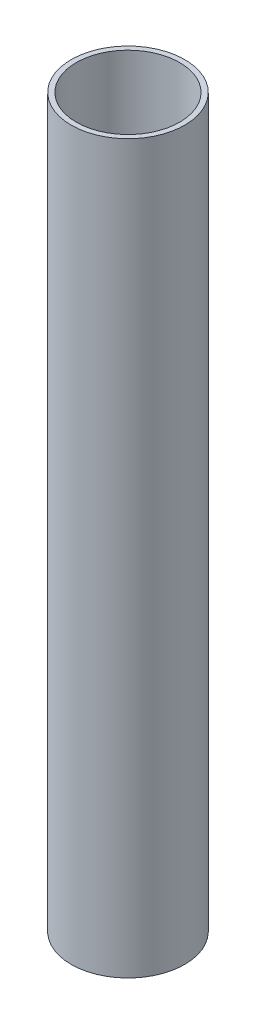
ISO-10303-21;
HEADER;
FILE_DESCRIPTION(('STEP AP214'),'2;1');
FILE_NAME('part.step','',(''),(''),'','','');
FILE_SCHEMA(('AUTOMOTIVE_DESIGN { 1 0 10303 214 1 1 1 1 }'));
ENDSEC;
DATA;
#1=APPLICATION_CONTEXT('core data for automotive mechanical design processes');
#2=APPLICATION_PROTOCOL_DEFINITION('international standard','automotive_design',2000,#1);
#3=PRODUCT_CONTEXT('',#1,'mechanical');
#4=PRODUCT('Part','Part','',(#3));
#5=PRODUCT_RELATED_PRODUCT_CATEGORY('part','',(#4));
#6=PRODUCT_DEFINITION_FORMATION('','',#4);
#7=PRODUCT_DEFINITION_CONTEXT('part definition',#1,'design');
#8=PRODUCT_DEFINITION('design','',#6,#7);
#9=PRODUCT_DEFINITION_SHAPE('','',#8);
#10=(LENGTH_UNIT() NAMED_UNIT(*) SI_UNIT(.MILLI.,.METRE.));
#11=(NAMED_UNIT(*) PLANE_ANGLE_UNIT() SI_UNIT($,.RADIAN.));
#12=(NAMED_UNIT(*) SI_UNIT($,.STERADIAN.) SOLID_ANGLE_UNIT());
#13=UNCERTAINTY_MEASURE_WITH_UNIT(LENGTH_MEASURE(1.E-05),#10,'distance_accuracy_value','');
#14=(GEOMETRIC_REPRESENTATION_CONTEXT(3) GLOBAL_UNCERTAINTY_ASSIGNED_CONTEXT((#13)) GLOBAL_UNIT_ASSIGNED_CONTEXT((#10,
#11,#12)) REPRESENTATION_CONTEXT('',''));
#15=CARTESIAN_POINT('',(0.,0.,0.));
#16=DIRECTION('',(0.,0.,1.));
#17=DIRECTION('',(1.,0.,0.));
#18=AXIS2_PLACEMENT_3D('',#15,#16,#17);
#19=CARTESIAN_POINT('',(0.,101.6,0.));
#20=DIRECTION('',(0.,1.,0.));
#21=DIRECTION('',(0.,0.,1.));
#22=AXIS2_PLACEMENT_3D('',#19,#20,#21);
#23=PLANE('',#22);
#24=CARTESIAN_POINT('',(0.,101.6,0.));
#25=DIRECTION('',(0.,1.,0.));
#26=DIRECTION('',(0.,0.,1.));
#27=AXIS2_PLACEMENT_3D('',#24,#25,#26);
#28=CIRCLE('',#27,7.9375);
#29=CARTESIAN_POINT('',(0.,101.6,7.9375));
#30=VERTEX_POINT('',#29);
#31=EDGE_CURVE('E10',#30,#30,#28,.T.);
#32=ORIENTED_EDGE('',*,*,#31,.T.);
#33=EDGE_LOOP('',(#32));
#34=FACE_BOUND('',#33,.T.);
#35=CARTESIAN_POINT('',(0.,101.6,0.));
#36=DIRECTION('',(0.,1.,0.));
#37=DIRECTION('',(0.,0.,1.));
#38=AXIS2_PLACEMENT_3D('',#35,#36,#37);
#39=CIRCLE('',#38,7.2263);
#40=CARTESIAN_POINT('',(0.,101.6,7.2263));
#41=VERTEX_POINT('',#40);
#42=EDGE_CURVE('E42',#41,#41,#39,.T.);
#43=ORIENTED_EDGE('',*,*,#42,.F.);
#44=EDGE_LOOP('',(#43));
#45=FACE_BOUND('',#44,.T.);
#46=ADVANCED_FACE('F31',(#34,#45),#23,.T.);
#47=CARTESIAN_POINT('',(0.,0.,0.));
#48=DIRECTION('',(0.,1.,0.));
#49=DIRECTION('',(0.,0.,1.));
#50=AXIS2_PLACEMENT_3D('',#47,#48,#49);
#51=PLANE('',#50);
#52=CARTESIAN_POINT('',(0.,0.,0.));
#53=DIRECTION('',(0.,1.,0.));
#54=DIRECTION('',(0.,0.,1.));
#55=AXIS2_PLACEMENT_3D('',#52,#53,#54);
#56=CIRCLE('',#55,7.9375);
#57=CARTESIAN_POINT('',(0.,0.,7.9375));
#58=VERTEX_POINT('',#57);
#59=EDGE_CURVE('E35',#58,#58,#56,.T.);
#60=ORIENTED_EDGE('',*,*,#59,.F.);
#61=EDGE_LOOP('',(#60));
#62=FACE_BOUND('',#61,.T.);
#63=CARTESIAN_POINT('',(0.,0.,0.));
#64=DIRECTION('',(0.,1.,0.));
#65=DIRECTION('',(0.,0.,1.));
#66=AXIS2_PLACEMENT_3D('',#63,#64,#65);
#67=CIRCLE('',#66,7.2263);
#68=CARTESIAN_POINT('',(0.,0.,7.2263));
#69=VERTEX_POINT('',#68);
#70=EDGE_CURVE('E44',#69,#69,#67,.T.);
#71=ORIENTED_EDGE('',*,*,#70,.T.);
#72=EDGE_LOOP('',(#71));
#73=FACE_BOUND('',#72,.T.);
#74=ADVANCED_FACE('F54',(#62,#73),#51,.F.);
#75=CARTESIAN_POINT('',(0.,101.6,0.));
#76=DIRECTION('',(0.,-1.,0.));
#77=DIRECTION('',(0.,0.,-1.));
#78=AXIS2_PLACEMENT_3D('',#75,#76,#77);
#79=CYLINDRICAL_SURFACE('',#78,7.9375);
#80=ORIENTED_EDGE('',*,*,#31,.F.);
#81=EDGE_LOOP('',(#80));
#82=FACE_BOUND('',#81,.T.);
#83=ORIENTED_EDGE('',*,*,#59,.T.);
#84=EDGE_LOOP('',(#83));
#85=FACE_BOUND('',#84,.T.);
#86=ADVANCED_FACE('F33',(#82,#85),#79,.T.);
#87=CARTESIAN_POINT('',(0.,101.6,0.));
#88=DIRECTION('',(0.,-1.,0.));
#89=DIRECTION('',(0.,0.,-1.));
#90=AXIS2_PLACEMENT_3D('',#87,#88,#89);
#91=CYLINDRICAL_SURFACE('',#90,7.2263);
#92=ORIENTED_EDGE('',*,*,#42,.T.);
#93=EDGE_LOOP('',(#92));
#94=FACE_BOUND('',#93,.T.);
#95=ORIENTED_EDGE('',*,*,#70,.F.);
#96=EDGE_LOOP('',(#95));
#97=FACE_BOUND('',#96,.T.);
#98=ADVANCED_FACE('F50',(#94,#97),#91,.F.);
#99=CLOSED_SHELL('',(#46,#74,#86,#98));
#100=MANIFOLD_SOLID_BREP('B2',#99);
#101=ADVANCED_BREP_SHAPE_REPRESENTATION('',(#18,#100),#14);
#102=SHAPE_DEFINITION_REPRESENTATION(#9,#101);
ENDSEC;
END-ISO-10303-21;
